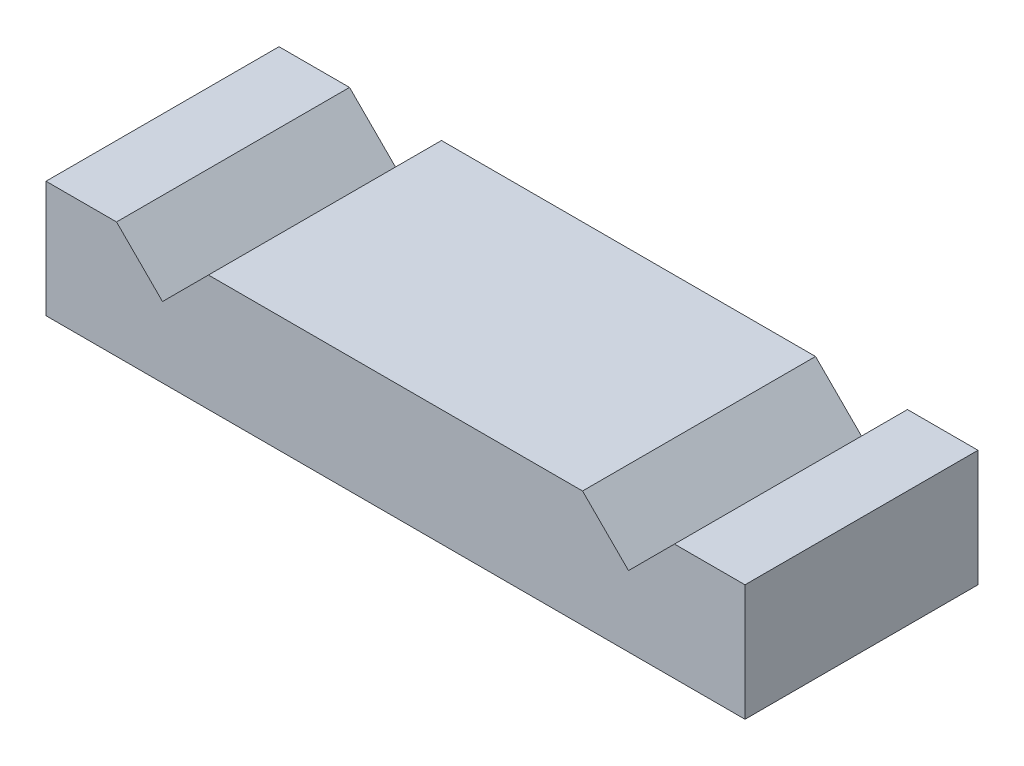
ISO-10303-21;
HEADER;
FILE_DESCRIPTION(('STEP AP214'),'2;1');
FILE_NAME('part.step','',(''),(''),'','','');
FILE_SCHEMA(('AUTOMOTIVE_DESIGN { 1 0 10303 214 1 1 1 1 }'));
ENDSEC;
DATA;
#1=APPLICATION_CONTEXT('core data for automotive mechanical design processes');
#2=APPLICATION_PROTOCOL_DEFINITION('international standard','automotive_design',2000,#1);
#3=PRODUCT_CONTEXT('',#1,'mechanical');
#4=PRODUCT('Part','Part','',(#3));
#5=PRODUCT_RELATED_PRODUCT_CATEGORY('part','',(#4));
#6=PRODUCT_DEFINITION_FORMATION('','',#4);
#7=PRODUCT_DEFINITION_CONTEXT('part definition',#1,'design');
#8=PRODUCT_DEFINITION('design','',#6,#7);
#9=PRODUCT_DEFINITION_SHAPE('','',#8);
#10=(LENGTH_UNIT() NAMED_UNIT(*) SI_UNIT(.MILLI.,.METRE.));
#11=(NAMED_UNIT(*) PLANE_ANGLE_UNIT() SI_UNIT($,.RADIAN.));
#12=(NAMED_UNIT(*) SI_UNIT($,.STERADIAN.) SOLID_ANGLE_UNIT());
#13=UNCERTAINTY_MEASURE_WITH_UNIT(LENGTH_MEASURE(1.E-05),#10,'distance_accuracy_value','');
#14=(GEOMETRIC_REPRESENTATION_CONTEXT(3) GLOBAL_UNCERTAINTY_ASSIGNED_CONTEXT((#13)) GLOBAL_UNIT_ASSIGNED_CONTEXT((#10,
#11,#12)) REPRESENTATION_CONTEXT('',''));
#15=CARTESIAN_POINT('',(0.,0.,0.));
#16=DIRECTION('',(0.,0.,1.));
#17=DIRECTION('',(1.,0.,0.));
#18=AXIS2_PLACEMENT_3D('',#15,#16,#17);
#19=CARTESIAN_POINT('',(0.,10.,0.));
#20=DIRECTION('',(0.,0.,-1.));
#21=DIRECTION('',(-1.,0.,0.));
#22=AXIS2_PLACEMENT_3D('',#19,#20,#21);
#23=PLANE('',#22);
#24=DIRECTION('',(-0.707106781186547,0.707106781186548,0.));
#25=VECTOR('',#24,1.);
#26=CARTESIAN_POINT('',(28.0273868198901,28.02738681989,0.));
#27=LINE('',#26,#25);
#28=CARTESIAN_POINT('',(50.,6.05477363978007,0.));
#29=VERTEX_POINT('',#28);
#30=CARTESIAN_POINT('',(46.0547736397801,10.,0.));
#31=VERTEX_POINT('',#30);
#32=EDGE_CURVE('E122',#29,#31,#27,.T.);
#33=ORIENTED_EDGE('',*,*,#32,.T.);
#34=DIRECTION('',(1.,0.,0.));
#35=VECTOR('',#34,1.);
#36=CARTESIAN_POINT('',(0.,10.,0.));
#37=LINE('',#36,#35);
#38=CARTESIAN_POINT('',(13.9452263602199,10.,0.));
#39=VERTEX_POINT('',#38);
#40=EDGE_CURVE('E169',#39,#31,#37,.T.);
#41=ORIENTED_EDGE('',*,*,#40,.F.);
#42=DIRECTION('',(0.707106781186547,0.707106781186548,0.));
#43=VECTOR('',#42,1.);
#44=CARTESIAN_POINT('',(10.,6.05477363978007,0.));
#45=LINE('',#44,#43);
#46=CARTESIAN_POINT('',(10.,6.05477363978007,0.));
#47=VERTEX_POINT('',#46);
#48=EDGE_CURVE('E140',#47,#39,#45,.T.);
#49=ORIENTED_EDGE('',*,*,#48,.F.);
#50=DIRECTION('',(-0.707106781186548,0.707106781186547,0.));
#51=VECTOR('',#50,1.);
#52=CARTESIAN_POINT('',(10.,6.05477363978007,0.));
#53=LINE('',#52,#51);
#54=CARTESIAN_POINT('',(6.05477363978007,10.,0.));
#55=VERTEX_POINT('',#54);
#56=EDGE_CURVE('E153',#47,#55,#53,.T.);
#57=ORIENTED_EDGE('',*,*,#56,.T.);
#58=CARTESIAN_POINT('',(0.,10.,0.));
#59=VERTEX_POINT('',#58);
#60=EDGE_CURVE('E165',#59,#55,#37,.T.);
#61=ORIENTED_EDGE('',*,*,#60,.F.);
#62=DIRECTION('',(0.,-1.,0.));
#63=VECTOR('',#62,1.);
#64=CARTESIAN_POINT('',(0.,10.,0.));
#65=LINE('',#64,#63);
#66=CARTESIAN_POINT('',(0.,0.,0.));
#67=VERTEX_POINT('',#66);
#68=EDGE_CURVE('E11',#59,#67,#65,.T.);
#69=ORIENTED_EDGE('',*,*,#68,.T.);
#70=DIRECTION('',(1.,0.,0.));
#71=VECTOR('',#70,1.);
#72=CARTESIAN_POINT('',(0.,0.,0.));
#73=LINE('',#72,#71);
#74=CARTESIAN_POINT('',(60.,0.,0.));
#75=VERTEX_POINT('',#74);
#76=EDGE_CURVE('E177',#67,#75,#73,.T.);
#77=ORIENTED_EDGE('',*,*,#76,.T.);
#78=DIRECTION('',(0.,-1.,0.));
#79=VECTOR('',#78,1.);
#80=CARTESIAN_POINT('',(60.,10.,0.));
#81=LINE('',#80,#79);
#82=CARTESIAN_POINT('',(60.,10.,0.));
#83=VERTEX_POINT('',#82);
#84=EDGE_CURVE('E47',#83,#75,#81,.T.);
#85=ORIENTED_EDGE('',*,*,#84,.F.);
#86=CARTESIAN_POINT('',(53.9452263602199,10.,0.));
#87=VERTEX_POINT('',#86);
#88=EDGE_CURVE('E163',#87,#83,#37,.T.);
#89=ORIENTED_EDGE('',*,*,#88,.F.);
#90=DIRECTION('',(0.707106781186548,0.707106781186547,0.));
#91=VECTOR('',#90,1.);
#92=CARTESIAN_POINT('',(21.9726131801099,-21.97261318011,0.));
#93=LINE('',#92,#91);
#94=EDGE_CURVE('E62',#29,#87,#93,.T.);
#95=ORIENTED_EDGE('',*,*,#94,.F.);
#96=EDGE_LOOP('',(#33,#41,#49,#57,#61,#69,#77,#85,#89,#95));
#97=FACE_BOUND('',#96,.T.);
#98=ADVANCED_FACE('F39',(#97),#23,.F.);
#99=CARTESIAN_POINT('',(0.,10.,-20.));
#100=DIRECTION('',(0.,0.,1.));
#101=DIRECTION('',(1.,0.,0.));
#102=AXIS2_PLACEMENT_3D('',#99,#100,#101);
#103=PLANE('',#102);
#104=DIRECTION('',(-0.707106781186547,0.707106781186548,0.));
#105=VECTOR('',#104,1.);
#106=CARTESIAN_POINT('',(28.0273868198901,28.02738681989,-20.));
#107=LINE('',#106,#105);
#108=CARTESIAN_POINT('',(50.,6.05477363978007,-20.));
#109=VERTEX_POINT('',#108);
#110=CARTESIAN_POINT('',(46.0547736397801,10.,-20.));
#111=VERTEX_POINT('',#110);
#112=EDGE_CURVE('E119',#109,#111,#107,.T.);
#113=ORIENTED_EDGE('',*,*,#112,.F.);
#114=DIRECTION('',(0.707106781186548,0.707106781186547,0.));
#115=VECTOR('',#114,1.);
#116=CARTESIAN_POINT('',(21.9726131801099,-21.97261318011,-20.));
#117=LINE('',#116,#115);
#118=CARTESIAN_POINT('',(53.9452263602199,10.,-20.));
#119=VERTEX_POINT('',#118);
#120=EDGE_CURVE('E124',#109,#119,#117,.T.);
#121=ORIENTED_EDGE('',*,*,#120,.T.);
#122=DIRECTION('',(-1.,0.,0.));
#123=VECTOR('',#122,1.);
#124=CARTESIAN_POINT('',(0.,10.,-20.));
#125=LINE('',#124,#123);
#126=CARTESIAN_POINT('',(60.,10.,-20.));
#127=VERTEX_POINT('',#126);
#128=EDGE_CURVE('E172',#127,#119,#125,.T.);
#129=ORIENTED_EDGE('',*,*,#128,.F.);
#130=DIRECTION('',(0.,-1.,0.));
#131=VECTOR('',#130,1.);
#132=CARTESIAN_POINT('',(60.,10.,-20.));
#133=LINE('',#132,#131);
#134=CARTESIAN_POINT('',(60.,0.,-20.));
#135=VERTEX_POINT('',#134);
#136=EDGE_CURVE('E184',#127,#135,#133,.T.);
#137=ORIENTED_EDGE('',*,*,#136,.T.);
#138=DIRECTION('',(-1.,0.,0.));
#139=VECTOR('',#138,1.);
#140=CARTESIAN_POINT('',(0.,0.,-20.));
#141=LINE('',#140,#139);
#142=CARTESIAN_POINT('',(0.,0.,-20.));
#143=VERTEX_POINT('',#142);
#144=EDGE_CURVE('E164',#135,#143,#141,.T.);
#145=ORIENTED_EDGE('',*,*,#144,.T.);
#146=DIRECTION('',(0.,-1.,0.));
#147=VECTOR('',#146,1.);
#148=CARTESIAN_POINT('',(0.,10.,-20.));
#149=LINE('',#148,#147);
#150=CARTESIAN_POINT('',(0.,10.,-20.));
#151=VERTEX_POINT('',#150);
#152=EDGE_CURVE('E174',#151,#143,#149,.T.);
#153=ORIENTED_EDGE('',*,*,#152,.F.);
#154=CARTESIAN_POINT('',(6.05477363978007,10.,-20.));
#155=VERTEX_POINT('',#154);
#156=EDGE_CURVE('E171',#155,#151,#125,.T.);
#157=ORIENTED_EDGE('',*,*,#156,.F.);
#158=DIRECTION('',(-0.707106781186548,0.707106781186547,0.));
#159=VECTOR('',#158,1.);
#160=CARTESIAN_POINT('',(10.,6.05477363978007,-20.));
#161=LINE('',#160,#159);
#162=CARTESIAN_POINT('',(10.,6.05477363978007,-20.));
#163=VERTEX_POINT('',#162);
#164=EDGE_CURVE('E54',#163,#155,#161,.T.);
#165=ORIENTED_EDGE('',*,*,#164,.F.);
#166=DIRECTION('',(0.707106781186547,0.707106781186548,0.));
#167=VECTOR('',#166,1.);
#168=CARTESIAN_POINT('',(10.,6.05477363978007,-20.));
#169=LINE('',#168,#167);
#170=CARTESIAN_POINT('',(13.9452263602199,10.,-20.));
#171=VERTEX_POINT('',#170);
#172=EDGE_CURVE('E156',#163,#171,#169,.T.);
#173=ORIENTED_EDGE('',*,*,#172,.T.);
#174=EDGE_CURVE('E136',#111,#171,#125,.T.);
#175=ORIENTED_EDGE('',*,*,#174,.F.);
#176=EDGE_LOOP('',(#113,#121,#129,#137,#145,#153,#157,#165,#173,#175));
#177=FACE_BOUND('',#176,.T.);
#178=ADVANCED_FACE('F133',(#177),#103,.F.);
#179=CARTESIAN_POINT('',(0.,10.,0.));
#180=DIRECTION('',(0.,-1.,0.));
#181=DIRECTION('',(0.,0.,-1.));
#182=AXIS2_PLACEMENT_3D('',#179,#180,#181);
#183=PLANE('',#182);
#184=DIRECTION('',(0.,0.,1.));
#185=VECTOR('',#184,1.);
#186=CARTESIAN_POINT('',(46.0547736397801,10.,-20.));
#187=LINE('',#186,#185);
#188=EDGE_CURVE('E142',#111,#31,#187,.T.);
#189=ORIENTED_EDGE('',*,*,#188,.F.);
#190=ORIENTED_EDGE('',*,*,#174,.T.);
#191=DIRECTION('',(0.,0.,1.));
#192=VECTOR('',#191,1.);
#193=CARTESIAN_POINT('',(13.9452263602199,10.,-20.));
#194=LINE('',#193,#192);
#195=EDGE_CURVE('E146',#171,#39,#194,.T.);
#196=ORIENTED_EDGE('',*,*,#195,.T.);
#197=ORIENTED_EDGE('',*,*,#40,.T.);
#198=EDGE_LOOP('',(#189,#190,#196,#197));
#199=FACE_BOUND('',#198,.T.);
#200=ADVANCED_FACE('F207',(#199),#183,.F.);
#201=DIRECTION('',(0.,0.,1.));
#202=VECTOR('',#201,1.);
#203=CARTESIAN_POINT('',(6.05477363978007,10.,-20.));
#204=LINE('',#203,#202);
#205=EDGE_CURVE('E151',#155,#55,#204,.T.);
#206=ORIENTED_EDGE('',*,*,#205,.F.);
#207=ORIENTED_EDGE('',*,*,#156,.T.);
#208=DIRECTION('',(0.,0.,1.));
#209=VECTOR('',#208,1.);
#210=CARTESIAN_POINT('',(0.,10.,0.));
#211=LINE('',#210,#209);
#212=EDGE_CURVE('E160',#151,#59,#211,.T.);
#213=ORIENTED_EDGE('',*,*,#212,.T.);
#214=ORIENTED_EDGE('',*,*,#60,.T.);
#215=EDGE_LOOP('',(#206,#207,#213,#214));
#216=FACE_BOUND('',#215,.T.);
#217=ADVANCED_FACE('F205',(#216),#183,.F.);
#218=CARTESIAN_POINT('',(0.,10.,0.));
#219=DIRECTION('',(1.,0.,0.));
#220=DIRECTION('',(0.,0.,-1.));
#221=AXIS2_PLACEMENT_3D('',#218,#219,#220);
#222=PLANE('',#221);
#223=DIRECTION('',(0.,0.,1.));
#224=VECTOR('',#223,1.);
#225=CARTESIAN_POINT('',(0.,0.,0.));
#226=LINE('',#225,#224);
#227=EDGE_CURVE('E144',#143,#67,#226,.T.);
#228=ORIENTED_EDGE('',*,*,#227,.T.);
#229=ORIENTED_EDGE('',*,*,#68,.F.);
#230=ORIENTED_EDGE('',*,*,#212,.F.);
#231=ORIENTED_EDGE('',*,*,#152,.T.);
#232=EDGE_LOOP('',(#228,#229,#230,#231));
#233=FACE_BOUND('',#232,.T.);
#234=ADVANCED_FACE('F41',(#233),#222,.F.);
#235=CARTESIAN_POINT('',(60.,10.,0.));
#236=DIRECTION('',(-1.,0.,0.));
#237=DIRECTION('',(0.,0.,1.));
#238=AXIS2_PLACEMENT_3D('',#235,#236,#237);
#239=PLANE('',#238);
#240=DIRECTION('',(0.,0.,-1.));
#241=VECTOR('',#240,1.);
#242=CARTESIAN_POINT('',(60.,0.,0.));
#243=LINE('',#242,#241);
#244=EDGE_CURVE('E179',#75,#135,#243,.T.);
#245=ORIENTED_EDGE('',*,*,#244,.T.);
#246=ORIENTED_EDGE('',*,*,#136,.F.);
#247=DIRECTION('',(0.,0.,-1.));
#248=VECTOR('',#247,1.);
#249=CARTESIAN_POINT('',(60.,10.,0.));
#250=LINE('',#249,#248);
#251=EDGE_CURVE('E168',#83,#127,#250,.T.);
#252=ORIENTED_EDGE('',*,*,#251,.F.);
#253=ORIENTED_EDGE('',*,*,#84,.T.);
#254=EDGE_LOOP('',(#245,#246,#252,#253));
#255=FACE_BOUND('',#254,.T.);
#256=ADVANCED_FACE('F191',(#255),#239,.F.);
#257=ORIENTED_EDGE('',*,*,#128,.T.);
#258=DIRECTION('',(0.,0.,1.));
#259=VECTOR('',#258,1.);
#260=CARTESIAN_POINT('',(53.9452263602199,10.,-20.));
#261=LINE('',#260,#259);
#262=EDGE_CURVE('E123',#119,#87,#261,.T.);
#263=ORIENTED_EDGE('',*,*,#262,.T.);
#264=ORIENTED_EDGE('',*,*,#88,.T.);
#265=ORIENTED_EDGE('',*,*,#251,.T.);
#266=EDGE_LOOP('',(#257,#263,#264,#265));
#267=FACE_BOUND('',#266,.T.);
#268=ADVANCED_FACE('F212',(#267),#183,.F.);
#269=CARTESIAN_POINT('',(0.,0.,0.));
#270=DIRECTION('',(0.,-1.,0.));
#271=DIRECTION('',(0.,0.,-1.));
#272=AXIS2_PLACEMENT_3D('',#269,#270,#271);
#273=PLANE('',#272);
#274=ORIENTED_EDGE('',*,*,#227,.F.);
#275=ORIENTED_EDGE('',*,*,#144,.F.);
#276=ORIENTED_EDGE('',*,*,#244,.F.);
#277=ORIENTED_EDGE('',*,*,#76,.F.);
#278=EDGE_LOOP('',(#274,#275,#276,#277));
#279=FACE_BOUND('',#278,.T.);
#280=ADVANCED_FACE('F198',(#279),#273,.T.);
#281=CARTESIAN_POINT('',(10.,6.05477363978007,-20.));
#282=DIRECTION('',(0.707106781186548,-0.707106781186547,0.));
#283=DIRECTION('',(0.707106781186547,0.707106781186548,0.));
#284=AXIS2_PLACEMENT_3D('',#281,#282,#283);
#285=PLANE('',#284);
#286=ORIENTED_EDGE('',*,*,#48,.T.);
#287=ORIENTED_EDGE('',*,*,#195,.F.);
#288=ORIENTED_EDGE('',*,*,#172,.F.);
#289=DIRECTION('',(0.,0.,1.));
#290=VECTOR('',#289,1.);
#291=CARTESIAN_POINT('',(10.,6.05477363978007,-20.));
#292=LINE('',#291,#290);
#293=EDGE_CURVE('E149',#163,#47,#292,.T.);
#294=ORIENTED_EDGE('',*,*,#293,.T.);
#295=EDGE_LOOP('',(#286,#287,#288,#294));
#296=FACE_BOUND('',#295,.T.);
#297=ADVANCED_FACE('F220',(#296),#285,.F.);
#298=CARTESIAN_POINT('',(10.,6.05477363978007,-20.));
#299=DIRECTION('',(0.707106781186547,0.707106781186548,0.));
#300=DIRECTION('',(-0.707106781186548,0.707106781186547,0.));
#301=AXIS2_PLACEMENT_3D('',#298,#299,#300);
#302=PLANE('',#301);
#303=ORIENTED_EDGE('',*,*,#56,.F.);
#304=ORIENTED_EDGE('',*,*,#293,.F.);
#305=ORIENTED_EDGE('',*,*,#164,.T.);
#306=ORIENTED_EDGE('',*,*,#205,.T.);
#307=EDGE_LOOP('',(#303,#304,#305,#306));
#308=FACE_BOUND('',#307,.T.);
#309=ADVANCED_FACE('F277',(#308),#302,.T.);
#310=CARTESIAN_POINT('',(28.0273868198901,28.02738681989,-20.));
#311=DIRECTION('',(0.707106781186548,0.707106781186547,0.));
#312=DIRECTION('',(-0.707106781186547,0.707106781186548,0.));
#313=AXIS2_PLACEMENT_3D('',#310,#311,#312);
#314=PLANE('',#313);
#315=ORIENTED_EDGE('',*,*,#32,.F.);
#316=DIRECTION('',(0.,0.,1.));
#317=VECTOR('',#316,1.);
#318=CARTESIAN_POINT('',(50.,6.05477363978007,-20.));
#319=LINE('',#318,#317);
#320=EDGE_CURVE('E115',#109,#29,#319,.T.);
#321=ORIENTED_EDGE('',*,*,#320,.F.);
#322=ORIENTED_EDGE('',*,*,#112,.T.);
#323=ORIENTED_EDGE('',*,*,#188,.T.);
#324=EDGE_LOOP('',(#315,#321,#322,#323));
#325=FACE_BOUND('',#324,.T.);
#326=ADVANCED_FACE('F117',(#325),#314,.T.);
#327=CARTESIAN_POINT('',(21.9726131801099,-21.97261318011,-20.));
#328=DIRECTION('',(0.707106781186547,-0.707106781186548,0.));
#329=DIRECTION('',(0.707106781186548,0.707106781186547,0.));
#330=AXIS2_PLACEMENT_3D('',#327,#328,#329);
#331=PLANE('',#330);
#332=ORIENTED_EDGE('',*,*,#94,.T.);
#333=ORIENTED_EDGE('',*,*,#262,.F.);
#334=ORIENTED_EDGE('',*,*,#120,.F.);
#335=ORIENTED_EDGE('',*,*,#320,.T.);
#336=EDGE_LOOP('',(#332,#333,#334,#335));
#337=FACE_BOUND('',#336,.T.);
#338=ADVANCED_FACE('F127',(#337),#331,.F.);
#339=CLOSED_SHELL('',(#98,#178,#200,#217,#234,#256,#268,#280,#297,#309,#326,#338));
#340=MANIFOLD_SOLID_BREP('B2',#339);
#341=ADVANCED_BREP_SHAPE_REPRESENTATION('',(#18,#340),#14);
#342=SHAPE_DEFINITION_REPRESENTATION(#9,#341);
ENDSEC;
END-ISO-10303-21;
